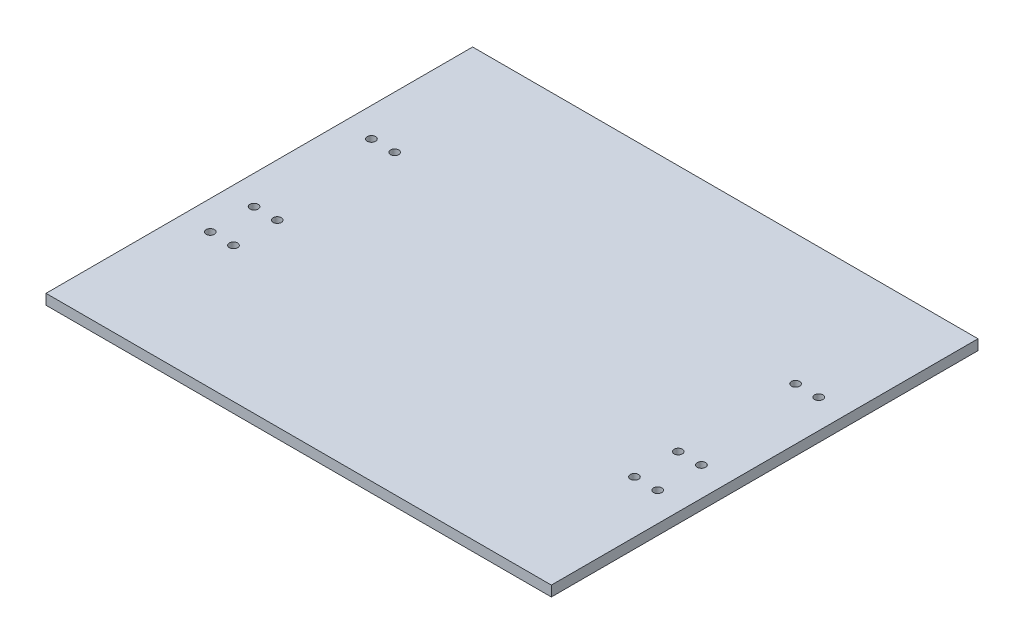
ISO-10303-21;
HEADER;
FILE_DESCRIPTION(('STEP AP214'),'2;1');
FILE_NAME('part.step','',(''),(''),'','','');
FILE_SCHEMA(('AUTOMOTIVE_DESIGN { 1 0 10303 214 1 1 1 1 }'));
ENDSEC;
DATA;
#1=APPLICATION_CONTEXT('core data for automotive mechanical design processes');
#2=APPLICATION_PROTOCOL_DEFINITION('international standard','automotive_design',2000,#1);
#3=PRODUCT_CONTEXT('',#1,'mechanical');
#4=PRODUCT('Part','Part','',(#3));
#5=PRODUCT_RELATED_PRODUCT_CATEGORY('part','',(#4));
#6=PRODUCT_DEFINITION_FORMATION('','',#4);
#7=PRODUCT_DEFINITION_CONTEXT('part definition',#1,'design');
#8=PRODUCT_DEFINITION('design','',#6,#7);
#9=PRODUCT_DEFINITION_SHAPE('','',#8);
#10=(LENGTH_UNIT() NAMED_UNIT(*) SI_UNIT(.MILLI.,.METRE.));
#11=(NAMED_UNIT(*) PLANE_ANGLE_UNIT() SI_UNIT($,.RADIAN.));
#12=(NAMED_UNIT(*) SI_UNIT($,.STERADIAN.) SOLID_ANGLE_UNIT());
#13=UNCERTAINTY_MEASURE_WITH_UNIT(LENGTH_MEASURE(1.E-05),#10,'distance_accuracy_value','');
#14=(GEOMETRIC_REPRESENTATION_CONTEXT(3) GLOBAL_UNCERTAINTY_ASSIGNED_CONTEXT((#13)) GLOBAL_UNIT_ASSIGNED_CONTEXT((#10,
#11,#12)) REPRESENTATION_CONTEXT('',''));
#15=CARTESIAN_POINT('',(0.,0.,0.));
#16=DIRECTION('',(0.,0.,1.));
#17=DIRECTION('',(1.,0.,0.));
#18=AXIS2_PLACEMENT_3D('',#15,#16,#17);
#19=CARTESIAN_POINT('',(-59.5,2.5,-51.5));
#20=DIRECTION('',(0.,0.,1.));
#21=DIRECTION('',(1.,0.,0.));
#22=AXIS2_PLACEMENT_3D('',#19,#20,#21);
#23=PLANE('',#22);
#24=DIRECTION('',(-1.,0.,0.));
#25=VECTOR('',#24,1.);
#26=CARTESIAN_POINT('',(-59.5,0.,-51.5));
#27=LINE('',#26,#25);
#28=CARTESIAN_POINT('',(61.,0.,-51.5));
#29=VERTEX_POINT('',#28);
#30=CARTESIAN_POINT('',(-61.,0.,-51.5));
#31=VERTEX_POINT('',#30);
#32=EDGE_CURVE('E83',#29,#31,#27,.T.);
#33=ORIENTED_EDGE('',*,*,#32,.T.);
#34=DIRECTION('',(0.,-1.,0.));
#35=VECTOR('',#34,1.);
#36=CARTESIAN_POINT('',(-61.,2.5,-51.5));
#37=LINE('',#36,#35);
#38=CARTESIAN_POINT('',(-61.,2.5,-51.5));
#39=VERTEX_POINT('',#38);
#40=EDGE_CURVE('E99',#39,#31,#37,.T.);
#41=ORIENTED_EDGE('',*,*,#40,.F.);
#42=DIRECTION('',(-1.,0.,0.));
#43=VECTOR('',#42,1.);
#44=CARTESIAN_POINT('',(-59.5,2.5,-51.5));
#45=LINE('',#44,#43);
#46=CARTESIAN_POINT('',(61.,2.5,-51.5));
#47=VERTEX_POINT('',#46);
#48=EDGE_CURVE('E45',#47,#39,#45,.T.);
#49=ORIENTED_EDGE('',*,*,#48,.F.);
#50=DIRECTION('',(0.,1.,0.));
#51=VECTOR('',#50,1.);
#52=CARTESIAN_POINT('',(61.,0.,-51.5));
#53=LINE('',#52,#51);
#54=EDGE_CURVE('E90',#29,#47,#53,.T.);
#55=ORIENTED_EDGE('',*,*,#54,.F.);
#56=EDGE_LOOP('',(#33,#41,#49,#55));
#57=FACE_BOUND('',#56,.T.);
#58=ADVANCED_FACE('F37',(#57),#23,.F.);
#59=CARTESIAN_POINT('',(-59.5,2.5,51.5));
#60=DIRECTION('',(0.,0.,-1.));
#61=DIRECTION('',(-1.,0.,0.));
#62=AXIS2_PLACEMENT_3D('',#59,#60,#61);
#63=PLANE('',#62);
#64=DIRECTION('',(1.,0.,0.));
#65=VECTOR('',#64,1.);
#66=CARTESIAN_POINT('',(-59.5,0.,51.5));
#67=LINE('',#66,#65);
#68=CARTESIAN_POINT('',(-61.,0.,51.5));
#69=VERTEX_POINT('',#68);
#70=CARTESIAN_POINT('',(61.,0.,51.5));
#71=VERTEX_POINT('',#70);
#72=EDGE_CURVE('E40',#69,#71,#67,.T.);
#73=ORIENTED_EDGE('',*,*,#72,.T.);
#74=DIRECTION('',(0.,-1.,0.));
#75=VECTOR('',#74,1.);
#76=CARTESIAN_POINT('',(61.,2.5,51.5));
#77=LINE('',#76,#75);
#78=CARTESIAN_POINT('',(61.,2.5,51.5));
#79=VERTEX_POINT('',#78);
#80=EDGE_CURVE('E78',#79,#71,#77,.T.);
#81=ORIENTED_EDGE('',*,*,#80,.F.);
#82=DIRECTION('',(1.,0.,0.));
#83=VECTOR('',#82,1.);
#84=CARTESIAN_POINT('',(-59.5,2.5,51.5));
#85=LINE('',#84,#83);
#86=CARTESIAN_POINT('',(-61.,2.5,51.5));
#87=VERTEX_POINT('',#86);
#88=EDGE_CURVE('E11',#87,#79,#85,.T.);
#89=ORIENTED_EDGE('',*,*,#88,.F.);
#90=DIRECTION('',(0.,1.,0.));
#91=VECTOR('',#90,1.);
#92=CARTESIAN_POINT('',(-61.,0.,51.5));
#93=LINE('',#92,#91);
#94=EDGE_CURVE('E79',#69,#87,#93,.T.);
#95=ORIENTED_EDGE('',*,*,#94,.F.);
#96=EDGE_LOOP('',(#73,#81,#89,#95));
#97=FACE_BOUND('',#96,.T.);
#98=ADVANCED_FACE('F76',(#97),#63,.F.);
#99=CARTESIAN_POINT('',(0.,2.5,0.));
#100=DIRECTION('',(0.,-1.,0.));
#101=DIRECTION('',(0.,0.,-1.));
#102=AXIS2_PLACEMENT_3D('',#99,#100,#101);
#103=PLANE('',#102);
#104=CARTESIAN_POINT('',(48.4,2.5,18.84));
#105=DIRECTION('',(0.,-1.,0.));
#106=DIRECTION('',(0.,0.,-1.));
#107=AXIS2_PLACEMENT_3D('',#104,#105,#106);
#108=CIRCLE('',#107,0.999999999999998);
#109=CARTESIAN_POINT('',(48.4,2.5,17.84));
#110=VERTEX_POINT('',#109);
#111=EDGE_CURVE('E110',#110,#110,#108,.T.);
#112=ORIENTED_EDGE('',*,*,#111,.T.);
#113=EDGE_LOOP('',(#112));
#114=FACE_BOUND('',#113,.T.);
#115=CARTESIAN_POINT('',(48.4,2.5,8.27000000000001));
#116=DIRECTION('',(0.,-1.,0.));
#117=DIRECTION('',(0.,0.,-1.));
#118=AXIS2_PLACEMENT_3D('',#115,#116,#117);
#119=CIRCLE('',#118,0.999999999999998);
#120=CARTESIAN_POINT('',(48.4,2.5,7.27000000000001));
#121=VERTEX_POINT('',#120);
#122=EDGE_CURVE('E116',#121,#121,#119,.T.);
#123=ORIENTED_EDGE('',*,*,#122,.T.);
#124=EDGE_LOOP('',(#123));
#125=FACE_BOUND('',#124,.T.);
#126=CARTESIAN_POINT('',(48.4,2.5,-20.06));
#127=DIRECTION('',(0.,-1.,0.));
#128=DIRECTION('',(0.,0.,-1.));
#129=AXIS2_PLACEMENT_3D('',#126,#127,#128);
#130=CIRCLE('',#129,0.999999999999998);
#131=CARTESIAN_POINT('',(48.4,2.5,-21.06));
#132=VERTEX_POINT('',#131);
#133=EDGE_CURVE('E122',#132,#132,#130,.T.);
#134=ORIENTED_EDGE('',*,*,#133,.T.);
#135=EDGE_LOOP('',(#134));
#136=FACE_BOUND('',#135,.T.);
#137=CARTESIAN_POINT('',(-48.4,2.5,8.27000000000001));
#138=DIRECTION('',(0.,-1.,0.));
#139=DIRECTION('',(0.,0.,-1.));
#140=AXIS2_PLACEMENT_3D('',#137,#138,#139);
#141=CIRCLE('',#140,0.999999999999998);
#142=CARTESIAN_POINT('',(-48.4,2.5,7.27000000000001));
#143=VERTEX_POINT('',#142);
#144=EDGE_CURVE('E128',#143,#143,#141,.T.);
#145=ORIENTED_EDGE('',*,*,#144,.T.);
#146=EDGE_LOOP('',(#145));
#147=FACE_BOUND('',#146,.T.);
#148=CARTESIAN_POINT('',(-48.4,2.5,-20.06));
#149=DIRECTION('',(0.,-1.,0.));
#150=DIRECTION('',(0.,0.,-1.));
#151=AXIS2_PLACEMENT_3D('',#148,#149,#150);
#152=CIRCLE('',#151,0.999999999999998);
#153=CARTESIAN_POINT('',(-48.4,2.5,-21.06));
#154=VERTEX_POINT('',#153);
#155=EDGE_CURVE('E134',#154,#154,#152,.T.);
#156=ORIENTED_EDGE('',*,*,#155,.T.);
#157=EDGE_LOOP('',(#156));
#158=FACE_BOUND('',#157,.T.);
#159=CARTESIAN_POINT('',(-48.4,2.5,18.84));
#160=DIRECTION('',(0.,-1.,0.));
#161=DIRECTION('',(0.,0.,-1.));
#162=AXIS2_PLACEMENT_3D('',#159,#160,#161);
#163=CIRCLE('',#162,0.999999999999998);
#164=CARTESIAN_POINT('',(-48.4,2.5,17.84));
#165=VERTEX_POINT('',#164);
#166=EDGE_CURVE('E140',#165,#165,#163,.T.);
#167=ORIENTED_EDGE('',*,*,#166,.T.);
#168=EDGE_LOOP('',(#167));
#169=FACE_BOUND('',#168,.T.);
#170=CARTESIAN_POINT('',(54.,2.5,18.84));
#171=DIRECTION('',(0.,-1.,0.));
#172=DIRECTION('',(0.,0.,-1.));
#173=AXIS2_PLACEMENT_3D('',#170,#171,#172);
#174=CIRCLE('',#173,0.999999999999998);
#175=CARTESIAN_POINT('',(54.,2.5,17.84));
#176=VERTEX_POINT('',#175);
#177=EDGE_CURVE('E146',#176,#176,#174,.T.);
#178=ORIENTED_EDGE('',*,*,#177,.T.);
#179=EDGE_LOOP('',(#178));
#180=FACE_BOUND('',#179,.T.);
#181=CARTESIAN_POINT('',(54.,2.5,8.27000000000001));
#182=DIRECTION('',(0.,-1.,0.));
#183=DIRECTION('',(0.,0.,-1.));
#184=AXIS2_PLACEMENT_3D('',#181,#182,#183);
#185=CIRCLE('',#184,0.999999999999998);
#186=CARTESIAN_POINT('',(54.,2.5,7.27000000000001));
#187=VERTEX_POINT('',#186);
#188=EDGE_CURVE('E152',#187,#187,#185,.T.);
#189=ORIENTED_EDGE('',*,*,#188,.T.);
#190=EDGE_LOOP('',(#189));
#191=FACE_BOUND('',#190,.T.);
#192=CARTESIAN_POINT('',(54.,2.5,-20.06));
#193=DIRECTION('',(0.,-1.,0.));
#194=DIRECTION('',(0.,0.,-1.));
#195=AXIS2_PLACEMENT_3D('',#192,#193,#194);
#196=CIRCLE('',#195,0.999999999999998);
#197=CARTESIAN_POINT('',(54.,2.5,-21.06));
#198=VERTEX_POINT('',#197);
#199=EDGE_CURVE('E158',#198,#198,#196,.T.);
#200=ORIENTED_EDGE('',*,*,#199,.T.);
#201=EDGE_LOOP('',(#200));
#202=FACE_BOUND('',#201,.T.);
#203=CARTESIAN_POINT('',(-54.,2.5,18.84));
#204=DIRECTION('',(0.,-1.,0.));
#205=DIRECTION('',(0.,0.,-1.));
#206=AXIS2_PLACEMENT_3D('',#203,#204,#205);
#207=CIRCLE('',#206,0.999999999999998);
#208=CARTESIAN_POINT('',(-54.,2.5,17.84));
#209=VERTEX_POINT('',#208);
#210=EDGE_CURVE('E164',#209,#209,#207,.T.);
#211=ORIENTED_EDGE('',*,*,#210,.T.);
#212=EDGE_LOOP('',(#211));
#213=FACE_BOUND('',#212,.T.);
#214=CARTESIAN_POINT('',(-54.,2.5,8.27000000000001));
#215=DIRECTION('',(0.,-1.,0.));
#216=DIRECTION('',(0.,0.,-1.));
#217=AXIS2_PLACEMENT_3D('',#214,#215,#216);
#218=CIRCLE('',#217,0.999999999999998);
#219=CARTESIAN_POINT('',(-54.,2.5,7.27000000000001));
#220=VERTEX_POINT('',#219);
#221=EDGE_CURVE('E170',#220,#220,#218,.T.);
#222=ORIENTED_EDGE('',*,*,#221,.T.);
#223=EDGE_LOOP('',(#222));
#224=FACE_BOUND('',#223,.T.);
#225=CARTESIAN_POINT('',(-54.,2.5,-20.06));
#226=DIRECTION('',(0.,-1.,0.));
#227=DIRECTION('',(0.,0.,-1.));
#228=AXIS2_PLACEMENT_3D('',#225,#226,#227);
#229=CIRCLE('',#228,0.999999999999998);
#230=CARTESIAN_POINT('',(-54.,2.5,-21.06));
#231=VERTEX_POINT('',#230);
#232=EDGE_CURVE('E176',#231,#231,#229,.T.);
#233=ORIENTED_EDGE('',*,*,#232,.T.);
#234=EDGE_LOOP('',(#233));
#235=FACE_BOUND('',#234,.T.);
#236=ORIENTED_EDGE('',*,*,#88,.T.);
#237=DIRECTION('',(0.,0.,1.));
#238=VECTOR('',#237,1.);
#239=CARTESIAN_POINT('',(61.,2.5,-51.5));
#240=LINE('',#239,#238);
#241=EDGE_CURVE('E94',#47,#79,#240,.T.);
#242=ORIENTED_EDGE('',*,*,#241,.F.);
#243=ORIENTED_EDGE('',*,*,#48,.T.);
#244=DIRECTION('',(0.,0.,-1.));
#245=VECTOR('',#244,1.);
#246=CARTESIAN_POINT('',(-61.,2.5,51.5));
#247=LINE('',#246,#245);
#248=EDGE_CURVE('E105',#87,#39,#247,.T.);
#249=ORIENTED_EDGE('',*,*,#248,.F.);
#250=EDGE_LOOP('',(#236,#242,#243,#249));
#251=FACE_BOUND('',#250,.T.);
#252=ADVANCED_FACE('F183',(#114,#125,#136,#147,#158,#169,#180,#191,#202,#213,#224,#235,#251),
#103,.F.);
#253=CARTESIAN_POINT('',(0.,0.,0.));
#254=DIRECTION('',(0.,-1.,0.));
#255=DIRECTION('',(0.,0.,-1.));
#256=AXIS2_PLACEMENT_3D('',#253,#254,#255);
#257=PLANE('',#256);
#258=CARTESIAN_POINT('',(48.4,0.,18.84));
#259=DIRECTION('',(0.,-1.,0.));
#260=DIRECTION('',(0.,0.,1.));
#261=AXIS2_PLACEMENT_3D('',#258,#259,#260);
#262=CIRCLE('',#261,0.999999999999998);
#263=CARTESIAN_POINT('',(48.4,0.,19.84));
#264=VERTEX_POINT('',#263);
#265=EDGE_CURVE('E107',#264,#264,#262,.T.);
#266=ORIENTED_EDGE('',*,*,#265,.F.);
#267=EDGE_LOOP('',(#266));
#268=FACE_BOUND('',#267,.T.);
#269=CARTESIAN_POINT('',(48.4,0.,8.27000000000001));
#270=DIRECTION('',(0.,-1.,0.));
#271=DIRECTION('',(0.,0.,1.));
#272=AXIS2_PLACEMENT_3D('',#269,#270,#271);
#273=CIRCLE('',#272,0.999999999999998);
#274=CARTESIAN_POINT('',(48.4,0.,9.27));
#275=VERTEX_POINT('',#274);
#276=EDGE_CURVE('E113',#275,#275,#273,.T.);
#277=ORIENTED_EDGE('',*,*,#276,.F.);
#278=EDGE_LOOP('',(#277));
#279=FACE_BOUND('',#278,.T.);
#280=CARTESIAN_POINT('',(48.4,0.,-20.06));
#281=DIRECTION('',(0.,-1.,0.));
#282=DIRECTION('',(0.,0.,1.));
#283=AXIS2_PLACEMENT_3D('',#280,#281,#282);
#284=CIRCLE('',#283,0.999999999999998);
#285=CARTESIAN_POINT('',(48.4,0.,-19.06));
#286=VERTEX_POINT('',#285);
#287=EDGE_CURVE('E119',#286,#286,#284,.T.);
#288=ORIENTED_EDGE('',*,*,#287,.F.);
#289=EDGE_LOOP('',(#288));
#290=FACE_BOUND('',#289,.T.);
#291=CARTESIAN_POINT('',(-48.4,0.,8.27000000000001));
#292=DIRECTION('',(0.,-1.,0.));
#293=DIRECTION('',(0.,0.,-1.));
#294=AXIS2_PLACEMENT_3D('',#291,#292,#293);
#295=CIRCLE('',#294,0.999999999999998);
#296=CARTESIAN_POINT('',(-48.4,0.,7.27000000000001));
#297=VERTEX_POINT('',#296);
#298=EDGE_CURVE('E125',#297,#297,#295,.T.);
#299=ORIENTED_EDGE('',*,*,#298,.F.);
#300=EDGE_LOOP('',(#299));
#301=FACE_BOUND('',#300,.T.);
#302=CARTESIAN_POINT('',(-48.4,0.,-20.06));
#303=DIRECTION('',(0.,-1.,0.));
#304=DIRECTION('',(0.,0.,-1.));
#305=AXIS2_PLACEMENT_3D('',#302,#303,#304);
#306=CIRCLE('',#305,0.999999999999998);
#307=CARTESIAN_POINT('',(-48.4,0.,-21.06));
#308=VERTEX_POINT('',#307);
#309=EDGE_CURVE('E131',#308,#308,#306,.T.);
#310=ORIENTED_EDGE('',*,*,#309,.F.);
#311=EDGE_LOOP('',(#310));
#312=FACE_BOUND('',#311,.T.);
#313=CARTESIAN_POINT('',(-48.4,0.,18.84));
#314=DIRECTION('',(0.,-1.,0.));
#315=DIRECTION('',(0.,0.,-1.));
#316=AXIS2_PLACEMENT_3D('',#313,#314,#315);
#317=CIRCLE('',#316,0.999999999999998);
#318=CARTESIAN_POINT('',(-48.4,0.,17.84));
#319=VERTEX_POINT('',#318);
#320=EDGE_CURVE('E137',#319,#319,#317,.T.);
#321=ORIENTED_EDGE('',*,*,#320,.F.);
#322=EDGE_LOOP('',(#321));
#323=FACE_BOUND('',#322,.T.);
#324=CARTESIAN_POINT('',(54.,0.,18.84));
#325=DIRECTION('',(0.,-1.,0.));
#326=DIRECTION('',(0.,0.,1.));
#327=AXIS2_PLACEMENT_3D('',#324,#325,#326);
#328=CIRCLE('',#327,0.999999999999998);
#329=CARTESIAN_POINT('',(54.,0.,19.84));
#330=VERTEX_POINT('',#329);
#331=EDGE_CURVE('E143',#330,#330,#328,.T.);
#332=ORIENTED_EDGE('',*,*,#331,.F.);
#333=EDGE_LOOP('',(#332));
#334=FACE_BOUND('',#333,.T.);
#335=CARTESIAN_POINT('',(54.,0.,8.27000000000001));
#336=DIRECTION('',(0.,-1.,0.));
#337=DIRECTION('',(0.,0.,1.));
#338=AXIS2_PLACEMENT_3D('',#335,#336,#337);
#339=CIRCLE('',#338,0.999999999999998);
#340=CARTESIAN_POINT('',(54.,0.,9.27));
#341=VERTEX_POINT('',#340);
#342=EDGE_CURVE('E149',#341,#341,#339,.T.);
#343=ORIENTED_EDGE('',*,*,#342,.F.);
#344=EDGE_LOOP('',(#343));
#345=FACE_BOUND('',#344,.T.);
#346=CARTESIAN_POINT('',(54.,0.,-20.06));
#347=DIRECTION('',(0.,-1.,0.));
#348=DIRECTION('',(0.,0.,1.));
#349=AXIS2_PLACEMENT_3D('',#346,#347,#348);
#350=CIRCLE('',#349,0.999999999999998);
#351=CARTESIAN_POINT('',(54.,0.,-19.06));
#352=VERTEX_POINT('',#351);
#353=EDGE_CURVE('E155',#352,#352,#350,.T.);
#354=ORIENTED_EDGE('',*,*,#353,.F.);
#355=EDGE_LOOP('',(#354));
#356=FACE_BOUND('',#355,.T.);
#357=CARTESIAN_POINT('',(-54.,0.,18.84));
#358=DIRECTION('',(0.,-1.,0.));
#359=DIRECTION('',(0.,0.,-1.));
#360=AXIS2_PLACEMENT_3D('',#357,#358,#359);
#361=CIRCLE('',#360,0.999999999999998);
#362=CARTESIAN_POINT('',(-54.,0.,17.84));
#363=VERTEX_POINT('',#362);
#364=EDGE_CURVE('E161',#363,#363,#361,.T.);
#365=ORIENTED_EDGE('',*,*,#364,.F.);
#366=EDGE_LOOP('',(#365));
#367=FACE_BOUND('',#366,.T.);
#368=CARTESIAN_POINT('',(-54.,0.,8.27000000000001));
#369=DIRECTION('',(0.,-1.,0.));
#370=DIRECTION('',(0.,0.,-1.));
#371=AXIS2_PLACEMENT_3D('',#368,#369,#370);
#372=CIRCLE('',#371,0.999999999999998);
#373=CARTESIAN_POINT('',(-54.,0.,7.27000000000001));
#374=VERTEX_POINT('',#373);
#375=EDGE_CURVE('E167',#374,#374,#372,.T.);
#376=ORIENTED_EDGE('',*,*,#375,.F.);
#377=EDGE_LOOP('',(#376));
#378=FACE_BOUND('',#377,.T.);
#379=CARTESIAN_POINT('',(-54.,0.,-20.06));
#380=DIRECTION('',(0.,-1.,0.));
#381=DIRECTION('',(0.,0.,-1.));
#382=AXIS2_PLACEMENT_3D('',#379,#380,#381);
#383=CIRCLE('',#382,0.999999999999998);
#384=CARTESIAN_POINT('',(-54.,0.,-21.06));
#385=VERTEX_POINT('',#384);
#386=EDGE_CURVE('E173',#385,#385,#383,.T.);
#387=ORIENTED_EDGE('',*,*,#386,.F.);
#388=EDGE_LOOP('',(#387));
#389=FACE_BOUND('',#388,.T.);
#390=ORIENTED_EDGE('',*,*,#32,.F.);
#391=DIRECTION('',(0.,0.,-1.));
#392=VECTOR('',#391,1.);
#393=CARTESIAN_POINT('',(61.,0.,51.5));
#394=LINE('',#393,#392);
#395=EDGE_CURVE('E85',#71,#29,#394,.T.);
#396=ORIENTED_EDGE('',*,*,#395,.F.);
#397=ORIENTED_EDGE('',*,*,#72,.F.);
#398=DIRECTION('',(0.,0.,1.));
#399=VECTOR('',#398,1.);
#400=CARTESIAN_POINT('',(-61.,0.,-51.5));
#401=LINE('',#400,#399);
#402=EDGE_CURVE('E102',#31,#69,#401,.T.);
#403=ORIENTED_EDGE('',*,*,#402,.F.);
#404=EDGE_LOOP('',(#390,#396,#397,#403));
#405=FACE_BOUND('',#404,.T.);
#406=ADVANCED_FACE('F86',(#268,#279,#290,#301,#312,#323,#334,#345,#356,#367,#378,#389,#405),
#257,.T.);
#407=CARTESIAN_POINT('',(-54.,10.,-20.06));
#408=DIRECTION('',(0.,-1.,0.));
#409=DIRECTION('',(0.,0.,-1.));
#410=AXIS2_PLACEMENT_3D('',#407,#408,#409);
#411=CYLINDRICAL_SURFACE('',#410,0.999999999999998);
#412=ORIENTED_EDGE('',*,*,#386,.T.);
#413=EDGE_LOOP('',(#412));
#414=FACE_BOUND('',#413,.T.);
#415=ORIENTED_EDGE('',*,*,#232,.F.);
#416=EDGE_LOOP('',(#415));
#417=FACE_BOUND('',#416,.T.);
#418=ADVANCED_FACE('F191',(#414,#417),#411,.F.);
#419=CARTESIAN_POINT('',(-54.,10.,8.27000000000001));
#420=DIRECTION('',(0.,-1.,0.));
#421=DIRECTION('',(0.,0.,-1.));
#422=AXIS2_PLACEMENT_3D('',#419,#420,#421);
#423=CYLINDRICAL_SURFACE('',#422,0.999999999999998);
#424=ORIENTED_EDGE('',*,*,#375,.T.);
#425=EDGE_LOOP('',(#424));
#426=FACE_BOUND('',#425,.T.);
#427=ORIENTED_EDGE('',*,*,#221,.F.);
#428=EDGE_LOOP('',(#427));
#429=FACE_BOUND('',#428,.T.);
#430=ADVANCED_FACE('F333',(#426,#429),#423,.F.);
#431=CARTESIAN_POINT('',(-54.,10.,18.84));
#432=DIRECTION('',(0.,-1.,0.));
#433=DIRECTION('',(0.,0.,-1.));
#434=AXIS2_PLACEMENT_3D('',#431,#432,#433);
#435=CYLINDRICAL_SURFACE('',#434,0.999999999999998);
#436=ORIENTED_EDGE('',*,*,#364,.T.);
#437=EDGE_LOOP('',(#436));
#438=FACE_BOUND('',#437,.T.);
#439=ORIENTED_EDGE('',*,*,#210,.F.);
#440=EDGE_LOOP('',(#439));
#441=FACE_BOUND('',#440,.T.);
#442=ADVANCED_FACE('F323',(#438,#441),#435,.F.);
#443=CARTESIAN_POINT('',(54.,10.,-20.06));
#444=DIRECTION('',(0.,-1.,0.));
#445=DIRECTION('',(0.,0.,-1.));
#446=AXIS2_PLACEMENT_3D('',#443,#444,#445);
#447=CYLINDRICAL_SURFACE('',#446,0.999999999999998);
#448=ORIENTED_EDGE('',*,*,#353,.T.);
#449=EDGE_LOOP('',(#448));
#450=FACE_BOUND('',#449,.T.);
#451=ORIENTED_EDGE('',*,*,#199,.F.);
#452=EDGE_LOOP('',(#451));
#453=FACE_BOUND('',#452,.T.);
#454=ADVANCED_FACE('F313',(#450,#453),#447,.F.);
#455=CARTESIAN_POINT('',(54.,10.,8.27000000000001));
#456=DIRECTION('',(0.,-1.,0.));
#457=DIRECTION('',(0.,0.,-1.));
#458=AXIS2_PLACEMENT_3D('',#455,#456,#457);
#459=CYLINDRICAL_SURFACE('',#458,0.999999999999998);
#460=ORIENTED_EDGE('',*,*,#342,.T.);
#461=EDGE_LOOP('',(#460));
#462=FACE_BOUND('',#461,.T.);
#463=ORIENTED_EDGE('',*,*,#188,.F.);
#464=EDGE_LOOP('',(#463));
#465=FACE_BOUND('',#464,.T.);
#466=ADVANCED_FACE('F303',(#462,#465),#459,.F.);
#467=CARTESIAN_POINT('',(54.,10.,18.84));
#468=DIRECTION('',(0.,-1.,0.));
#469=DIRECTION('',(0.,0.,-1.));
#470=AXIS2_PLACEMENT_3D('',#467,#468,#469);
#471=CYLINDRICAL_SURFACE('',#470,0.999999999999998);
#472=ORIENTED_EDGE('',*,*,#331,.T.);
#473=EDGE_LOOP('',(#472));
#474=FACE_BOUND('',#473,.T.);
#475=ORIENTED_EDGE('',*,*,#177,.F.);
#476=EDGE_LOOP('',(#475));
#477=FACE_BOUND('',#476,.T.);
#478=ADVANCED_FACE('F293',(#474,#477),#471,.F.);
#479=CARTESIAN_POINT('',(-48.4,10.,18.84));
#480=DIRECTION('',(0.,-1.,0.));
#481=DIRECTION('',(0.,0.,-1.));
#482=AXIS2_PLACEMENT_3D('',#479,#480,#481);
#483=CYLINDRICAL_SURFACE('',#482,0.999999999999998);
#484=ORIENTED_EDGE('',*,*,#320,.T.);
#485=EDGE_LOOP('',(#484));
#486=FACE_BOUND('',#485,.T.);
#487=ORIENTED_EDGE('',*,*,#166,.F.);
#488=EDGE_LOOP('',(#487));
#489=FACE_BOUND('',#488,.T.);
#490=ADVANCED_FACE('F283',(#486,#489),#483,.F.);
#491=CARTESIAN_POINT('',(-48.4,10.,-20.06));
#492=DIRECTION('',(0.,-1.,0.));
#493=DIRECTION('',(0.,0.,-1.));
#494=AXIS2_PLACEMENT_3D('',#491,#492,#493);
#495=CYLINDRICAL_SURFACE('',#494,0.999999999999998);
#496=ORIENTED_EDGE('',*,*,#309,.T.);
#497=EDGE_LOOP('',(#496));
#498=FACE_BOUND('',#497,.T.);
#499=ORIENTED_EDGE('',*,*,#155,.F.);
#500=EDGE_LOOP('',(#499));
#501=FACE_BOUND('',#500,.T.);
#502=ADVANCED_FACE('F273',(#498,#501),#495,.F.);
#503=CARTESIAN_POINT('',(-48.4,10.,8.27000000000001));
#504=DIRECTION('',(0.,-1.,0.));
#505=DIRECTION('',(0.,0.,-1.));
#506=AXIS2_PLACEMENT_3D('',#503,#504,#505);
#507=CYLINDRICAL_SURFACE('',#506,0.999999999999998);
#508=ORIENTED_EDGE('',*,*,#298,.T.);
#509=EDGE_LOOP('',(#508));
#510=FACE_BOUND('',#509,.T.);
#511=ORIENTED_EDGE('',*,*,#144,.F.);
#512=EDGE_LOOP('',(#511));
#513=FACE_BOUND('',#512,.T.);
#514=ADVANCED_FACE('F263',(#510,#513),#507,.F.);
#515=CARTESIAN_POINT('',(48.4,10.,-20.06));
#516=DIRECTION('',(0.,-1.,0.));
#517=DIRECTION('',(0.,0.,-1.));
#518=AXIS2_PLACEMENT_3D('',#515,#516,#517);
#519=CYLINDRICAL_SURFACE('',#518,0.999999999999998);
#520=ORIENTED_EDGE('',*,*,#287,.T.);
#521=EDGE_LOOP('',(#520));
#522=FACE_BOUND('',#521,.T.);
#523=ORIENTED_EDGE('',*,*,#133,.F.);
#524=EDGE_LOOP('',(#523));
#525=FACE_BOUND('',#524,.T.);
#526=ADVANCED_FACE('F253',(#522,#525),#519,.F.);
#527=CARTESIAN_POINT('',(48.4,10.,8.27000000000001));
#528=DIRECTION('',(0.,-1.,0.));
#529=DIRECTION('',(0.,0.,-1.));
#530=AXIS2_PLACEMENT_3D('',#527,#528,#529);
#531=CYLINDRICAL_SURFACE('',#530,0.999999999999998);
#532=ORIENTED_EDGE('',*,*,#276,.T.);
#533=EDGE_LOOP('',(#532));
#534=FACE_BOUND('',#533,.T.);
#535=ORIENTED_EDGE('',*,*,#122,.F.);
#536=EDGE_LOOP('',(#535));
#537=FACE_BOUND('',#536,.T.);
#538=ADVANCED_FACE('F244',(#534,#537),#531,.F.);
#539=CARTESIAN_POINT('',(48.4,10.,18.84));
#540=DIRECTION('',(0.,-1.,0.));
#541=DIRECTION('',(0.,0.,-1.));
#542=AXIS2_PLACEMENT_3D('',#539,#540,#541);
#543=CYLINDRICAL_SURFACE('',#542,0.999999999999998);
#544=ORIENTED_EDGE('',*,*,#265,.T.);
#545=EDGE_LOOP('',(#544));
#546=FACE_BOUND('',#545,.T.);
#547=ORIENTED_EDGE('',*,*,#111,.F.);
#548=EDGE_LOOP('',(#547));
#549=FACE_BOUND('',#548,.T.);
#550=ADVANCED_FACE('F204',(#546,#549),#543,.F.);
#551=CARTESIAN_POINT('',(-61.,0.,0.));
#552=DIRECTION('',(-1.,0.,0.));
#553=DIRECTION('',(0.,0.,1.));
#554=AXIS2_PLACEMENT_3D('',#551,#552,#553);
#555=PLANE('',#554);
#556=ORIENTED_EDGE('',*,*,#40,.T.);
#557=ORIENTED_EDGE('',*,*,#402,.T.);
#558=ORIENTED_EDGE('',*,*,#94,.T.);
#559=ORIENTED_EDGE('',*,*,#248,.T.);
#560=EDGE_LOOP('',(#556,#557,#558,#559));
#561=FACE_BOUND('',#560,.T.);
#562=ADVANCED_FACE('F182',(#561),#555,.T.);
#563=CARTESIAN_POINT('',(61.,0.,0.));
#564=DIRECTION('',(1.,0.,0.));
#565=DIRECTION('',(0.,0.,-1.));
#566=AXIS2_PLACEMENT_3D('',#563,#564,#565);
#567=PLANE('',#566);
#568=ORIENTED_EDGE('',*,*,#80,.T.);
#569=ORIENTED_EDGE('',*,*,#395,.T.);
#570=ORIENTED_EDGE('',*,*,#54,.T.);
#571=ORIENTED_EDGE('',*,*,#241,.T.);
#572=EDGE_LOOP('',(#568,#569,#570,#571));
#573=FACE_BOUND('',#572,.T.);
#574=ADVANCED_FACE('F93',(#573),#567,.T.);
#575=CLOSED_SHELL('',(#58,#98,#252,#406,#418,#430,#442,#454,#466,#478,#490,#502,#514,#526,#538,
#550,#562,#574));
#576=MANIFOLD_SOLID_BREP('B2',#575);
#577=ADVANCED_BREP_SHAPE_REPRESENTATION('',(#18,#576),#14);
#578=SHAPE_DEFINITION_REPRESENTATION(#9,#577);
ENDSEC;
END-ISO-10303-21;
